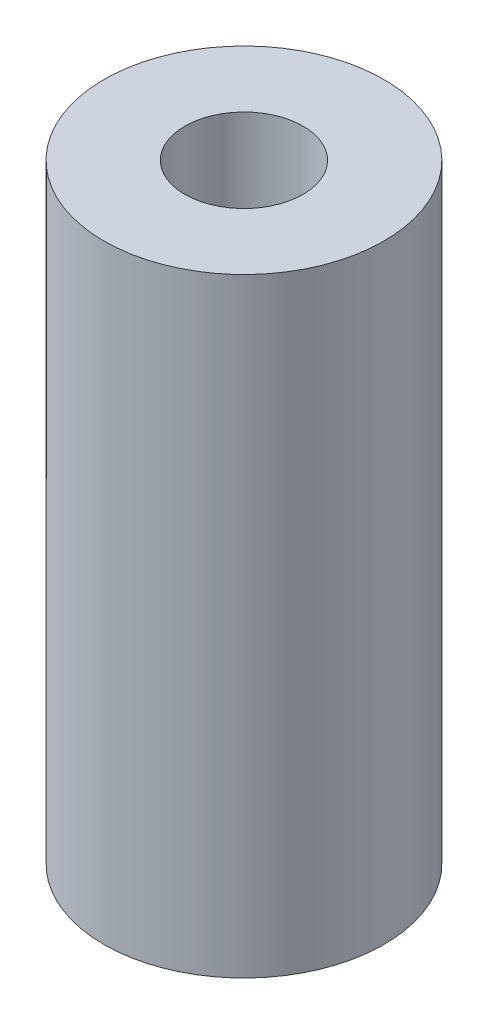
ISO-10303-21;
HEADER;
FILE_DESCRIPTION(('STEP AP214'),'2;1');
FILE_NAME('part.step','',(''),(''),'','','');
FILE_SCHEMA(('AUTOMOTIVE_DESIGN { 1 0 10303 214 1 1 1 1 }'));
ENDSEC;
DATA;
#1=APPLICATION_CONTEXT('core data for automotive mechanical design processes');
#2=APPLICATION_PROTOCOL_DEFINITION('international standard','automotive_design',2000,#1);
#3=PRODUCT_CONTEXT('',#1,'mechanical');
#4=PRODUCT('Part','Part','',(#3));
#5=PRODUCT_RELATED_PRODUCT_CATEGORY('part','',(#4));
#6=PRODUCT_DEFINITION_FORMATION('','',#4);
#7=PRODUCT_DEFINITION_CONTEXT('part definition',#1,'design');
#8=PRODUCT_DEFINITION('design','',#6,#7);
#9=PRODUCT_DEFINITION_SHAPE('','',#8);
#10=(LENGTH_UNIT() NAMED_UNIT(*) SI_UNIT(.MILLI.,.METRE.));
#11=(NAMED_UNIT(*) PLANE_ANGLE_UNIT() SI_UNIT($,.RADIAN.));
#12=(NAMED_UNIT(*) SI_UNIT($,.STERADIAN.) SOLID_ANGLE_UNIT());
#13=UNCERTAINTY_MEASURE_WITH_UNIT(LENGTH_MEASURE(1.E-05),#10,'distance_accuracy_value','');
#14=(GEOMETRIC_REPRESENTATION_CONTEXT(3) GLOBAL_UNCERTAINTY_ASSIGNED_CONTEXT((#13)) GLOBAL_UNIT_ASSIGNED_CONTEXT((#10,
#11,#12)) REPRESENTATION_CONTEXT('',''));
#15=CARTESIAN_POINT('',(0.,0.,0.));
#16=DIRECTION('',(0.,0.,1.));
#17=DIRECTION('',(1.,0.,0.));
#18=AXIS2_PLACEMENT_3D('',#15,#16,#17);
#19=CARTESIAN_POINT('',(0.,-6.,0.));
#20=DIRECTION('',(0.,1.,0.));
#21=DIRECTION('',(0.,0.,1.));
#22=AXIS2_PLACEMENT_3D('',#19,#20,#21);
#23=CYLINDRICAL_SURFACE('',#22,11.8300044214405);
#24=CARTESIAN_POINT('',(0.,-6.,0.));
#25=DIRECTION('',(0.,1.,0.));
#26=DIRECTION('',(0.,0.,1.));
#27=AXIS2_PLACEMENT_3D('',#24,#25,#26);
#28=CIRCLE('',#27,11.8300044214405);
#29=CARTESIAN_POINT('',(0.,-6.,11.8300044214405));
#30=VERTEX_POINT('',#29);
#31=EDGE_CURVE('E10',#30,#30,#28,.T.);
#32=ORIENTED_EDGE('',*,*,#31,.T.);
#33=EDGE_LOOP('',(#32));
#34=FACE_BOUND('',#33,.T.);
#35=CARTESIAN_POINT('',(0.,45.5,0.));
#36=DIRECTION('',(0.,1.,0.));
#37=DIRECTION('',(0.,0.,1.));
#38=AXIS2_PLACEMENT_3D('',#35,#36,#37);
#39=CIRCLE('',#38,11.8300044214405);
#40=CARTESIAN_POINT('',(0.,45.5,11.8300044214405));
#41=VERTEX_POINT('',#40);
#42=EDGE_CURVE('E41',#41,#41,#39,.T.);
#43=ORIENTED_EDGE('',*,*,#42,.F.);
#44=EDGE_LOOP('',(#43));
#45=FACE_BOUND('',#44,.T.);
#46=ADVANCED_FACE('F31',(#34,#45),#23,.T.);
#47=CARTESIAN_POINT('',(0.,-6.,0.));
#48=DIRECTION('',(0.,1.,0.));
#49=DIRECTION('',(0.,0.,1.));
#50=AXIS2_PLACEMENT_3D('',#47,#48,#49);
#51=PLANE('',#50);
#52=CARTESIAN_POINT('',(0.,-6.,0.));
#53=DIRECTION('',(0.,1.,0.));
#54=DIRECTION('',(0.,0.,1.));
#55=AXIS2_PLACEMENT_3D('',#52,#53,#54);
#56=CIRCLE('',#55,5.);
#57=CARTESIAN_POINT('',(0.,-6.,5.));
#58=VERTEX_POINT('',#57);
#59=EDGE_CURVE('E37',#58,#58,#56,.T.);
#60=ORIENTED_EDGE('',*,*,#59,.T.);
#61=EDGE_LOOP('',(#60));
#62=FACE_BOUND('',#61,.T.);
#63=ORIENTED_EDGE('',*,*,#31,.F.);
#64=EDGE_LOOP('',(#63));
#65=FACE_BOUND('',#64,.T.);
#66=ADVANCED_FACE('F60',(#62,#65),#51,.F.);
#67=CARTESIAN_POINT('',(0.,-6.,0.));
#68=DIRECTION('',(0.,1.,0.));
#69=DIRECTION('',(0.,0.,1.));
#70=AXIS2_PLACEMENT_3D('',#67,#68,#69);
#71=CYLINDRICAL_SURFACE('',#70,5.);
#72=ORIENTED_EDGE('',*,*,#59,.F.);
#73=EDGE_LOOP('',(#72));
#74=FACE_BOUND('',#73,.T.);
#75=CARTESIAN_POINT('',(0.,45.5,0.));
#76=DIRECTION('',(0.,1.,0.));
#77=DIRECTION('',(0.,0.,1.));
#78=AXIS2_PLACEMENT_3D('',#75,#76,#77);
#79=CIRCLE('',#78,5.);
#80=CARTESIAN_POINT('',(0.,45.5,5.));
#81=VERTEX_POINT('',#80);
#82=EDGE_CURVE('E45',#81,#81,#79,.T.);
#83=ORIENTED_EDGE('',*,*,#82,.T.);
#84=EDGE_LOOP('',(#83));
#85=FACE_BOUND('',#84,.T.);
#86=ADVANCED_FACE('F51',(#74,#85),#71,.F.);
#87=CARTESIAN_POINT('',(0.,45.5,0.));
#88=DIRECTION('',(0.,1.,0.));
#89=DIRECTION('',(0.,0.,1.));
#90=AXIS2_PLACEMENT_3D('',#87,#88,#89);
#91=PLANE('',#90);
#92=ORIENTED_EDGE('',*,*,#42,.T.);
#93=EDGE_LOOP('',(#92));
#94=FACE_BOUND('',#93,.T.);
#95=ORIENTED_EDGE('',*,*,#82,.F.);
#96=EDGE_LOOP('',(#95));
#97=FACE_BOUND('',#96,.T.);
#98=ADVANCED_FACE('F53',(#94,#97),#91,.T.);
#99=CLOSED_SHELL('',(#46,#66,#86,#98));
#100=MANIFOLD_SOLID_BREP('B2',#99);
#101=ADVANCED_BREP_SHAPE_REPRESENTATION('',(#18,#100),#14);
#102=SHAPE_DEFINITION_REPRESENTATION(#9,#101);
ENDSEC;
END-ISO-10303-21;
